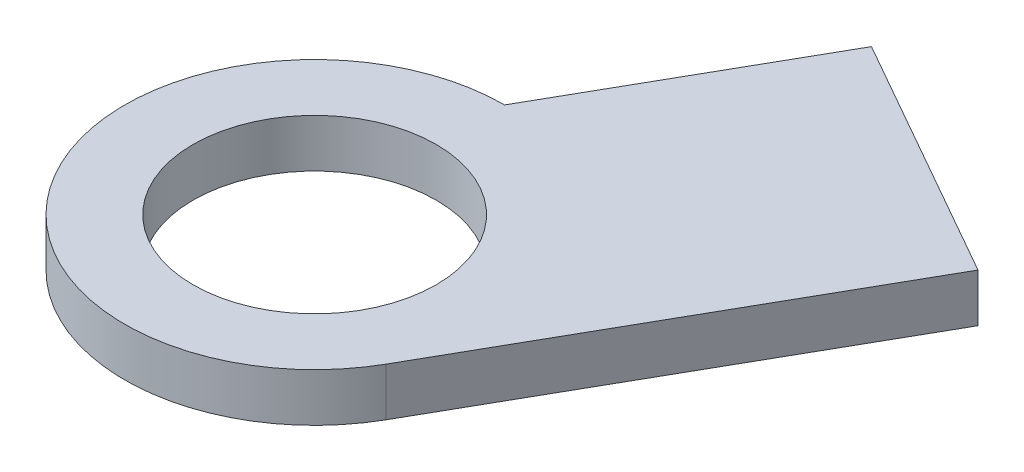
ISO-10303-21;
HEADER;
FILE_DESCRIPTION(('STEP AP214'),'2;1');
FILE_NAME('part.step','',(''),(''),'','','');
FILE_SCHEMA(('AUTOMOTIVE_DESIGN { 1 0 10303 214 1 1 1 1 }'));
ENDSEC;
DATA;
#1=APPLICATION_CONTEXT('core data for automotive mechanical design processes');
#2=APPLICATION_PROTOCOL_DEFINITION('international standard','automotive_design',2000,#1);
#3=PRODUCT_CONTEXT('',#1,'mechanical');
#4=PRODUCT('Part','Part','',(#3));
#5=PRODUCT_RELATED_PRODUCT_CATEGORY('part','',(#4));
#6=PRODUCT_DEFINITION_FORMATION('','',#4);
#7=PRODUCT_DEFINITION_CONTEXT('part definition',#1,'design');
#8=PRODUCT_DEFINITION('design','',#6,#7);
#9=PRODUCT_DEFINITION_SHAPE('','',#8);
#10=(LENGTH_UNIT() NAMED_UNIT(*) SI_UNIT(.MILLI.,.METRE.));
#11=(NAMED_UNIT(*) PLANE_ANGLE_UNIT() SI_UNIT($,.RADIAN.));
#12=(NAMED_UNIT(*) SI_UNIT($,.STERADIAN.) SOLID_ANGLE_UNIT());
#13=UNCERTAINTY_MEASURE_WITH_UNIT(LENGTH_MEASURE(1.E-05),#10,'distance_accuracy_value','');
#14=(GEOMETRIC_REPRESENTATION_CONTEXT(3) GLOBAL_UNCERTAINTY_ASSIGNED_CONTEXT((#13)) GLOBAL_UNIT_ASSIGNED_CONTEXT((#10,
#11,#12)) REPRESENTATION_CONTEXT('',''));
#15=CARTESIAN_POINT('',(0.,0.,0.));
#16=DIRECTION('',(0.,0.,1.));
#17=DIRECTION('',(1.,0.,0.));
#18=AXIS2_PLACEMENT_3D('',#15,#16,#17);
#19=CARTESIAN_POINT('',(0.,17.6,0.));
#20=DIRECTION('',(0.,-1.,0.));
#21=DIRECTION('',(0.,0.,-1.));
#22=AXIS2_PLACEMENT_3D('',#19,#20,#21);
#23=CYLINDRICAL_SURFACE('',#22,12.5);
#24=DIRECTION('',(0.,1.,0.));
#25=VECTOR('',#24,1.);
#26=CARTESIAN_POINT('',(0.,0.,-12.5));
#27=LINE('',#26,#25);
#28=CARTESIAN_POINT('',(0.,14.425,-12.5));
#29=VERTEX_POINT('',#28);
#30=CARTESIAN_POINT('',(0.,17.6,-12.5));
#31=VERTEX_POINT('',#30);
#32=EDGE_CURVE('E65',#29,#31,#27,.T.);
#33=ORIENTED_EDGE('',*,*,#32,.F.);
#34=CARTESIAN_POINT('',(0.,14.425,0.));
#35=DIRECTION('',(0.,1.,0.));
#36=DIRECTION('',(0.,0.,1.));
#37=AXIS2_PLACEMENT_3D('',#34,#35,#36);
#38=CIRCLE('',#37,12.5);
#39=CARTESIAN_POINT('',(10.8679556307404,14.425,6.17555992669964));
#40=VERTEX_POINT('',#39);
#41=EDGE_CURVE('E58',#40,#29,#38,.F.);
#42=ORIENTED_EDGE('',*,*,#41,.F.);
#43=DIRECTION('',(0.,1.,0.));
#44=VECTOR('',#43,1.);
#45=CARTESIAN_POINT('',(10.8679556307404,0.,6.17555992669964));
#46=LINE('',#45,#44);
#47=CARTESIAN_POINT('',(10.8679556307404,17.6,6.17555992669964));
#48=VERTEX_POINT('',#47);
#49=EDGE_CURVE('E94',#40,#48,#46,.T.);
#50=ORIENTED_EDGE('',*,*,#49,.T.);
#51=CARTESIAN_POINT('',(0.,17.6,0.));
#52=DIRECTION('',(0.,1.,0.));
#53=DIRECTION('',(0.,0.,1.));
#54=AXIS2_PLACEMENT_3D('',#51,#52,#53);
#55=CIRCLE('',#54,12.5);
#56=EDGE_CURVE('E12',#31,#48,#55,.T.);
#57=ORIENTED_EDGE('',*,*,#56,.F.);
#58=EDGE_LOOP('',(#33,#42,#50,#57));
#59=FACE_BOUND('',#58,.T.);
#60=ADVANCED_FACE('F43',(#59),#23,.T.);
#61=CARTESIAN_POINT('',(0.,17.6,0.));
#62=DIRECTION('',(0.,1.,0.));
#63=DIRECTION('',(0.,0.,1.));
#64=AXIS2_PLACEMENT_3D('',#61,#62,#63);
#65=PLANE('',#64);
#66=CARTESIAN_POINT('',(0.,17.6,0.));
#67=DIRECTION('',(0.,1.,0.));
#68=DIRECTION('',(0.,0.,1.));
#69=AXIS2_PLACEMENT_3D('',#66,#67,#68);
#70=CIRCLE('',#69,8.);
#71=CARTESIAN_POINT('',(0.,17.6,8.));
#72=VERTEX_POINT('',#71);
#73=EDGE_CURVE('E51',#72,#72,#70,.T.);
#74=ORIENTED_EDGE('',*,*,#73,.F.);
#75=EDGE_LOOP('',(#74));
#76=FACE_BOUND('',#75,.T.);
#77=ORIENTED_EDGE('',*,*,#56,.T.);
#78=DIRECTION('',(0.494044794135972,0.,-0.86943645045923));
#79=VECTOR('',#78,1.);
#80=CARTESIAN_POINT('',(10.8679556307404,17.6,6.17555992669964));
#81=LINE('',#80,#79);
#82=CARTESIAN_POINT('',(24.9852856231758,17.6,-18.6685866451729));
#83=VERTEX_POINT('',#82);
#84=EDGE_CURVE('E101',#48,#83,#81,.T.);
#85=ORIENTED_EDGE('',*,*,#84,.T.);
#86=DIRECTION('',(-0.86943645045923,0.,-0.494044794135972));
#87=VECTOR('',#86,1.);
#88=CARTESIAN_POINT('',(14.1173299924354,17.6,-24.8441465718725));
#89=LINE('',#88,#87);
#90=CARTESIAN_POINT('',(8.74807309016739,17.6,-27.8951498045332));
#91=VERTEX_POINT('',#90);
#92=EDGE_CURVE('E126',#83,#91,#89,.T.);
#93=ORIENTED_EDGE('',*,*,#92,.T.);
#94=DIRECTION('',(-0.494044794135971,0.,0.869436450459231));
#95=VECTOR('',#94,1.);
#96=CARTESIAN_POINT('',(-5.36925690226799,17.6,-3.05100323266067));
#97=LINE('',#96,#95);
#98=EDGE_CURVE('E124',#91,#31,#97,.T.);
#99=ORIENTED_EDGE('',*,*,#98,.T.);
#100=EDGE_LOOP('',(#77,#85,#93,#99));
#101=FACE_BOUND('',#100,.T.);
#102=ADVANCED_FACE('F119',(#76,#101),#65,.T.);
#103=CARTESIAN_POINT('',(0.,-22.6274169979695,0.));
#104=DIRECTION('',(0.,1.,0.));
#105=DIRECTION('',(0.,0.,1.));
#106=AXIS2_PLACEMENT_3D('',#103,#104,#105);
#107=CYLINDRICAL_SURFACE('',#106,8.);
#108=CARTESIAN_POINT('',(0.,14.425,0.));
#109=DIRECTION('',(0.,1.,0.));
#110=DIRECTION('',(0.,0.,1.));
#111=AXIS2_PLACEMENT_3D('',#108,#109,#110);
#112=CIRCLE('',#111,8.);
#113=CARTESIAN_POINT('',(0.,14.425,8.));
#114=VERTEX_POINT('',#113);
#115=EDGE_CURVE('E96',#114,#114,#112,.F.);
#116=CARTESIAN_POINT('',(0.,14.425,8.));
#117=CARTESIAN_POINT('',(0.,14.4580729166667,8.));
#118=CARTESIAN_POINT('',(0.,14.4911458333333,8.));
#119=CARTESIAN_POINT('',(0.,14.5572916666667,8.));
#120=CARTESIAN_POINT('',(0.,14.5903645833333,8.));
#121=CARTESIAN_POINT('',(0.,14.6565104166667,8.));
#122=CARTESIAN_POINT('',(0.,14.6895833333333,8.));
#123=CARTESIAN_POINT('',(0.,14.7557291666667,8.));
#124=CARTESIAN_POINT('',(0.,14.7888020833333,8.));
#125=CARTESIAN_POINT('',(0.,14.8549479166667,8.));
#126=CARTESIAN_POINT('',(0.,14.8880208333333,8.));
#127=CARTESIAN_POINT('',(0.,14.9541666666667,8.));
#128=CARTESIAN_POINT('',(0.,14.9872395833333,8.));
#129=CARTESIAN_POINT('',(0.,15.0533854166667,8.));
#130=CARTESIAN_POINT('',(0.,15.0864583333333,8.));
#131=CARTESIAN_POINT('',(0.,15.1526041666667,8.));
#132=CARTESIAN_POINT('',(0.,15.1856770833333,8.));
#133=CARTESIAN_POINT('',(0.,15.2518229166667,8.));
#134=CARTESIAN_POINT('',(0.,15.2848958333333,8.));
#135=CARTESIAN_POINT('',(0.,15.3510416666667,8.));
#136=CARTESIAN_POINT('',(0.,15.3841145833333,8.));
#137=CARTESIAN_POINT('',(0.,15.4502604166667,8.));
#138=CARTESIAN_POINT('',(0.,15.4833333333333,8.));
#139=CARTESIAN_POINT('',(0.,15.5494791666667,8.));
#140=CARTESIAN_POINT('',(0.,15.5825520833333,8.));
#141=CARTESIAN_POINT('',(0.,15.6486979166667,8.));
#142=CARTESIAN_POINT('',(0.,15.6817708333333,8.));
#143=CARTESIAN_POINT('',(0.,15.7479166666667,8.));
#144=CARTESIAN_POINT('',(0.,15.7809895833333,8.));
#145=CARTESIAN_POINT('',(0.,15.8471354166667,8.));
#146=CARTESIAN_POINT('',(0.,15.8802083333333,8.));
#147=CARTESIAN_POINT('',(0.,15.9463541666667,8.));
#148=CARTESIAN_POINT('',(0.,15.9794270833333,8.));
#149=CARTESIAN_POINT('',(0.,16.0455729166667,8.));
#150=CARTESIAN_POINT('',(0.,16.0786458333333,8.));
#151=CARTESIAN_POINT('',(0.,16.1447916666667,8.));
#152=CARTESIAN_POINT('',(0.,16.1778645833333,8.));
#153=CARTESIAN_POINT('',(0.,16.2440104166667,8.));
#154=CARTESIAN_POINT('',(0.,16.2770833333333,8.));
#155=CARTESIAN_POINT('',(0.,16.3432291666667,8.));
#156=CARTESIAN_POINT('',(0.,16.3763020833333,8.));
#157=CARTESIAN_POINT('',(0.,16.4424479166667,8.));
#158=CARTESIAN_POINT('',(0.,16.4755208333333,8.));
#159=CARTESIAN_POINT('',(0.,16.5416666666667,8.));
#160=CARTESIAN_POINT('',(0.,16.5747395833333,8.));
#161=CARTESIAN_POINT('',(0.,16.6408854166667,8.));
#162=CARTESIAN_POINT('',(0.,16.6739583333333,8.));
#163=CARTESIAN_POINT('',(0.,16.7401041666667,8.));
#164=CARTESIAN_POINT('',(0.,16.7731770833333,8.));
#165=CARTESIAN_POINT('',(0.,16.8393229166667,8.));
#166=CARTESIAN_POINT('',(0.,16.8723958333333,8.));
#167=CARTESIAN_POINT('',(0.,16.9385416666667,8.));
#168=CARTESIAN_POINT('',(0.,16.9716145833333,8.));
#169=CARTESIAN_POINT('',(0.,17.0377604166667,8.));
#170=CARTESIAN_POINT('',(0.,17.0708333333333,8.));
#171=CARTESIAN_POINT('',(0.,17.1369791666667,8.));
#172=CARTESIAN_POINT('',(0.,17.1700520833333,8.));
#173=CARTESIAN_POINT('',(0.,17.2361979166667,8.));
#174=CARTESIAN_POINT('',(0.,17.2692708333333,8.));
#175=CARTESIAN_POINT('',(0.,17.3354166666667,8.));
#176=CARTESIAN_POINT('',(0.,17.3684895833333,8.));
#177=CARTESIAN_POINT('',(0.,17.4346354166667,8.));
#178=CARTESIAN_POINT('',(0.,17.4677083333333,8.));
#179=CARTESIAN_POINT('',(0.,17.5338541666667,8.));
#180=CARTESIAN_POINT('',(0.,17.5669270833333,8.));
#181=CARTESIAN_POINT('',(0.,17.6,8.));
#182=B_SPLINE_CURVE_WITH_KNOTS('',3,(#116,#117,#118,#119,#120,#121,#122,#123,#124,#125,#126,
#127,#128,#129,#130,#131,#132,#133,#134,#135,#136,#137,#138,#139,#140,#141,#142,#143,#144,#145,
#146,#147,#148,#149,#150,#151,#152,#153,#154,#155,#156,#157,#158,#159,#160,#161,#162,#163,#164,
#165,#166,#167,#168,#169,#170,#171,#172,#173,#174,#175,#176,#177,#178,#179,#180,#181),
.UNSPECIFIED.,.F.,.F.,(4,2,2,2,2,2,2,2,2,2,2,2,2,2,2,2,2,2,2,2,2,2,2,2,2,2,2,2,2,2,2,2,4),(0.,
0.0992187499999977,0.198437500000002,0.29765625,0.396875000000005,0.496093750000003,0.5953125,
0.694531250000005,0.793750000000003,0.892968750000001,0.992187500000005,1.09140625,1.190625,
1.28984375000001,1.3890625,1.48828125000001,1.58750000000001,1.68671875,1.78593750000001,
1.88515625000001,1.98437500000001,2.08359375000001,2.18281250000001,2.28203125000001,
2.38125000000001,2.48046875000001,2.57968750000001,2.67890625000001,2.77812500000001,
2.87734375000001,2.97656250000001,3.07578125000001,3.17500000000001),.UNSPECIFIED.);
#183=EDGE_CURVE('BSEAM117',#114,#72,#182,.T.);
#184=ORIENTED_EDGE('',*,*,#115,.T.);
#185=ORIENTED_EDGE('',*,*,#73,.T.);
#186=ORIENTED_EDGE('',*,*,#183,.T.);
#187=ORIENTED_EDGE('',*,*,#183,.F.);
#188=EDGE_LOOP('',(#184,#186,#185,#187));
#189=FACE_BOUND('',#188,.T.);
#190=ADVANCED_FACE('F117',(#189),#107,.F.);
#191=CARTESIAN_POINT('',(14.1173299924354,0.,-24.8441465718725));
#192=DIRECTION('',(0.494044794135972,0.,-0.86943645045923));
#193=DIRECTION('',(-0.86943645045923,0.,-0.494044794135972));
#194=AXIS2_PLACEMENT_3D('',#191,#192,#193);
#195=PLANE('',#194);
#196=DIRECTION('',(0.86943645045923,0.,0.494044794135972));
#197=VECTOR('',#196,1.);
#198=CARTESIAN_POINT('',(14.1173299924354,14.425,-24.8441465718725));
#199=LINE('',#198,#197);
#200=CARTESIAN_POINT('',(8.74807309016739,14.425,-27.8951498045332));
#201=VERTEX_POINT('',#200);
#202=CARTESIAN_POINT('',(24.9852856231758,14.425,-18.6685866451729));
#203=VERTEX_POINT('',#202);
#204=EDGE_CURVE('E87',#201,#203,#199,.T.);
#205=ORIENTED_EDGE('',*,*,#204,.F.);
#206=DIRECTION('',(0.,1.,0.));
#207=VECTOR('',#206,1.);
#208=CARTESIAN_POINT('',(8.74807309016739,0.,-27.8951498045332));
#209=LINE('',#208,#207);
#210=EDGE_CURVE('E108',#201,#91,#209,.T.);
#211=ORIENTED_EDGE('',*,*,#210,.T.);
#212=ORIENTED_EDGE('',*,*,#92,.F.);
#213=DIRECTION('',(0.,1.,0.));
#214=VECTOR('',#213,1.);
#215=CARTESIAN_POINT('',(24.9852856231758,0.,-18.6685866451729));
#216=LINE('',#215,#214);
#217=EDGE_CURVE('E103',#203,#83,#216,.T.);
#218=ORIENTED_EDGE('',*,*,#217,.F.);
#219=EDGE_LOOP('',(#205,#211,#212,#218));
#220=FACE_BOUND('',#219,.T.);
#221=ADVANCED_FACE('F142',(#220),#195,.T.);
#222=CARTESIAN_POINT('',(10.8679556307404,0.,6.17555992669964));
#223=DIRECTION('',(0.86943645045923,0.,0.494044794135971));
#224=DIRECTION('',(0.494044794135972,0.,-0.86943645045923));
#225=AXIS2_PLACEMENT_3D('',#222,#223,#224);
#226=PLANE('',#225);
#227=DIRECTION('',(-0.494044794135972,0.,0.86943645045923));
#228=VECTOR('',#227,1.);
#229=CARTESIAN_POINT('',(10.8679556307404,14.425,6.17555992669964));
#230=LINE('',#229,#228);
#231=EDGE_CURVE('E83',#203,#40,#230,.T.);
#232=ORIENTED_EDGE('',*,*,#231,.F.);
#233=ORIENTED_EDGE('',*,*,#217,.T.);
#234=ORIENTED_EDGE('',*,*,#84,.F.);
#235=ORIENTED_EDGE('',*,*,#49,.F.);
#236=EDGE_LOOP('',(#232,#233,#234,#235));
#237=FACE_BOUND('',#236,.T.);
#238=ADVANCED_FACE('F99',(#237),#226,.T.);
#239=CARTESIAN_POINT('',(-5.36925690226799,0.,-3.05100323266067));
#240=DIRECTION('',(-0.86943645045923,0.,-0.494044794135971));
#241=DIRECTION('',(-0.494044794135971,0.,0.869436450459231));
#242=AXIS2_PLACEMENT_3D('',#239,#240,#241);
#243=PLANE('',#242);
#244=DIRECTION('',(0.494044794135971,0.,-0.869436450459231));
#245=VECTOR('',#244,1.);
#246=CARTESIAN_POINT('',(-5.36925690226798,14.425,-3.05100323266067));
#247=LINE('',#246,#245);
#248=EDGE_CURVE('E139',#29,#201,#247,.T.);
#249=ORIENTED_EDGE('',*,*,#248,.F.);
#250=ORIENTED_EDGE('',*,*,#32,.T.);
#251=ORIENTED_EDGE('',*,*,#98,.F.);
#252=ORIENTED_EDGE('',*,*,#210,.F.);
#253=EDGE_LOOP('',(#249,#250,#251,#252));
#254=FACE_BOUND('',#253,.T.);
#255=ADVANCED_FACE('F143',(#254),#243,.T.);
#256=CARTESIAN_POINT('',(0.,14.425,0.));
#257=DIRECTION('',(0.,1.,0.));
#258=DIRECTION('',(0.,0.,1.));
#259=AXIS2_PLACEMENT_3D('',#256,#257,#258);
#260=PLANE('',#259);
#261=ORIENTED_EDGE('',*,*,#231,.T.);
#262=ORIENTED_EDGE('',*,*,#41,.T.);
#263=ORIENTED_EDGE('',*,*,#248,.T.);
#264=ORIENTED_EDGE('',*,*,#204,.T.);
#265=EDGE_LOOP('',(#261,#262,#263,#264));
#266=FACE_BOUND('',#265,.T.);
#267=ORIENTED_EDGE('',*,*,#115,.F.);
#268=EDGE_LOOP('',(#267));
#269=FACE_BOUND('',#268,.T.);
#270=ADVANCED_FACE('F84',(#266,#269),#260,.F.);
#271=CLOSED_SHELL('',(#60,#102,#190,#221,#238,#255,#270));
#272=MANIFOLD_SOLID_BREP('B2',#271);
#273=ADVANCED_BREP_SHAPE_REPRESENTATION('',(#18,#272),#14);
#274=SHAPE_DEFINITION_REPRESENTATION(#9,#273);
ENDSEC;
END-ISO-10303-21;
